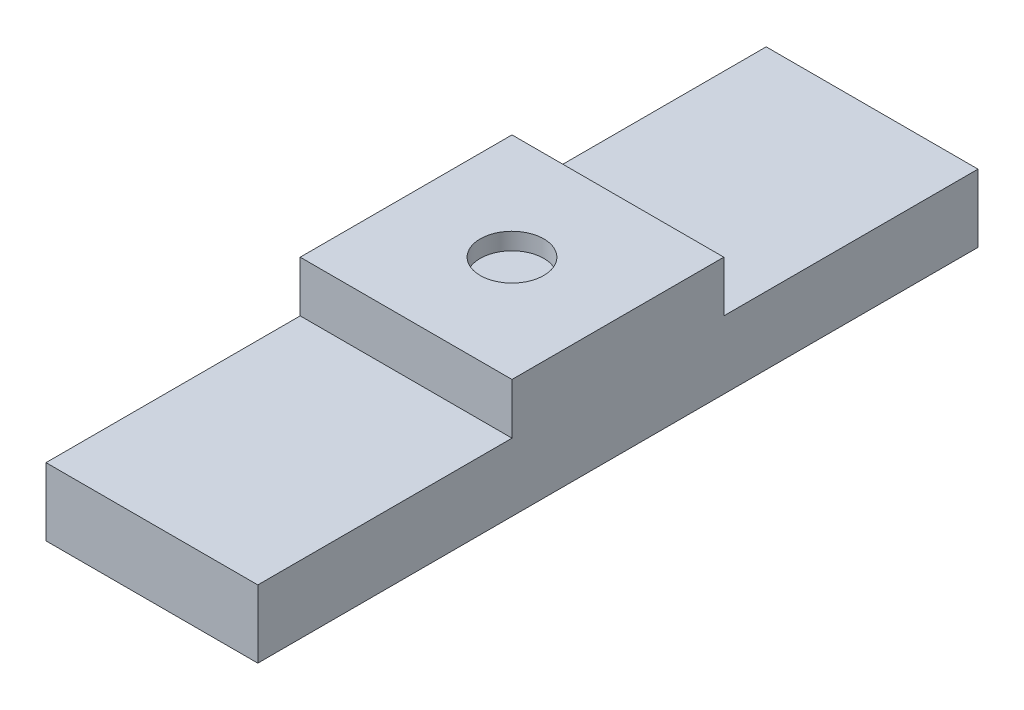
ISO-10303-21;
HEADER;
FILE_DESCRIPTION(('STEP AP214'),'2;1');
FILE_NAME('part.step','',(''),(''),'','','');
FILE_SCHEMA(('AUTOMOTIVE_DESIGN { 1 0 10303 214 1 1 1 1 }'));
ENDSEC;
DATA;
#1=APPLICATION_CONTEXT('core data for automotive mechanical design processes');
#2=APPLICATION_PROTOCOL_DEFINITION('international standard','automotive_design',2000,#1);
#3=PRODUCT_CONTEXT('',#1,'mechanical');
#4=PRODUCT('Part','Part','',(#3));
#5=PRODUCT_RELATED_PRODUCT_CATEGORY('part','',(#4));
#6=PRODUCT_DEFINITION_FORMATION('','',#4);
#7=PRODUCT_DEFINITION_CONTEXT('part definition',#1,'design');
#8=PRODUCT_DEFINITION('design','',#6,#7);
#9=PRODUCT_DEFINITION_SHAPE('','',#8);
#10=(LENGTH_UNIT() NAMED_UNIT(*) SI_UNIT(.MILLI.,.METRE.));
#11=(NAMED_UNIT(*) PLANE_ANGLE_UNIT() SI_UNIT($,.RADIAN.));
#12=(NAMED_UNIT(*) SI_UNIT($,.STERADIAN.) SOLID_ANGLE_UNIT());
#13=UNCERTAINTY_MEASURE_WITH_UNIT(LENGTH_MEASURE(1.E-05),#10,'distance_accuracy_value','');
#14=(GEOMETRIC_REPRESENTATION_CONTEXT(3) GLOBAL_UNCERTAINTY_ASSIGNED_CONTEXT((#13)) GLOBAL_UNIT_ASSIGNED_CONTEXT((#10,
#11,#12)) REPRESENTATION_CONTEXT('',''));
#15=CARTESIAN_POINT('',(0.,0.,0.));
#16=DIRECTION('',(0.,0.,1.));
#17=DIRECTION('',(1.,0.,0.));
#18=AXIS2_PLACEMENT_3D('',#15,#16,#17);
#19=CARTESIAN_POINT('',(0.,0.8,0.));
#20=DIRECTION('',(0.,-1.,0.));
#21=DIRECTION('',(0.,0.,-1.));
#22=AXIS2_PLACEMENT_3D('',#19,#20,#21);
#23=PLANE('',#22);
#24=DIRECTION('',(-1.,0.,0.));
#25=VECTOR('',#24,1.);
#26=CARTESIAN_POINT('',(2.5,0.8,-5.5));
#27=LINE('',#26,#25);
#28=CARTESIAN_POINT('',(2.5,0.8,-5.5));
#29=VERTEX_POINT('',#28);
#30=CARTESIAN_POINT('',(0.,0.8,-5.5));
#31=VERTEX_POINT('',#30);
#32=EDGE_CURVE('E50',#29,#31,#27,.T.);
#33=ORIENTED_EDGE('',*,*,#32,.F.);
#34=DIRECTION('',(0.,0.,-1.));
#35=VECTOR('',#34,1.);
#36=CARTESIAN_POINT('',(2.5,0.8,0.));
#37=LINE('',#36,#35);
#38=CARTESIAN_POINT('',(2.5,0.8,-8.5));
#39=VERTEX_POINT('',#38);
#40=EDGE_CURVE('E171',#29,#39,#37,.T.);
#41=ORIENTED_EDGE('',*,*,#40,.T.);
#42=DIRECTION('',(-1.,0.,0.));
#43=VECTOR('',#42,1.);
#44=CARTESIAN_POINT('',(0.,0.8,-8.5));
#45=LINE('',#44,#43);
#46=CARTESIAN_POINT('',(0.,0.8,-8.5));
#47=VERTEX_POINT('',#46);
#48=EDGE_CURVE('E161',#39,#47,#45,.T.);
#49=ORIENTED_EDGE('',*,*,#48,.T.);
#50=DIRECTION('',(0.,0.,1.));
#51=VECTOR('',#50,1.);
#52=CARTESIAN_POINT('',(0.,0.8,0.));
#53=LINE('',#52,#51);
#54=EDGE_CURVE('E151',#47,#31,#53,.T.);
#55=ORIENTED_EDGE('',*,*,#54,.T.);
#56=EDGE_LOOP('',(#33,#41,#49,#55));
#57=FACE_BOUND('',#56,.T.);
#58=ADVANCED_FACE('F33',(#57),#23,.F.);
#59=DIRECTION('',(1.,0.,0.));
#60=VECTOR('',#59,1.);
#61=CARTESIAN_POINT('',(2.5,0.8,-3.));
#62=LINE('',#61,#60);
#63=CARTESIAN_POINT('',(0.,0.8,-3.));
#64=VERTEX_POINT('',#63);
#65=CARTESIAN_POINT('',(2.5,0.8,-3.));
#66=VERTEX_POINT('',#65);
#67=EDGE_CURVE('E58',#64,#66,#62,.T.);
#68=ORIENTED_EDGE('',*,*,#67,.F.);
#69=CARTESIAN_POINT('',(0.,0.8,0.));
#70=VERTEX_POINT('',#69);
#71=EDGE_CURVE('E122',#64,#70,#53,.T.);
#72=ORIENTED_EDGE('',*,*,#71,.T.);
#73=DIRECTION('',(1.,0.,0.));
#74=VECTOR('',#73,1.);
#75=CARTESIAN_POINT('',(0.,0.8,0.));
#76=LINE('',#75,#74);
#77=CARTESIAN_POINT('',(2.5,0.8,0.));
#78=VERTEX_POINT('',#77);
#79=EDGE_CURVE('E145',#70,#78,#76,.T.);
#80=ORIENTED_EDGE('',*,*,#79,.T.);
#81=EDGE_CURVE('E167',#78,#66,#37,.T.);
#82=ORIENTED_EDGE('',*,*,#81,.T.);
#83=EDGE_LOOP('',(#68,#72,#80,#82));
#84=FACE_BOUND('',#83,.T.);
#85=ADVANCED_FACE('F177',(#84),#23,.F.);
#86=CARTESIAN_POINT('',(0.,0.8,0.));
#87=DIRECTION('',(1.,0.,0.));
#88=DIRECTION('',(0.,0.,-1.));
#89=AXIS2_PLACEMENT_3D('',#86,#87,#88);
#90=PLANE('',#89);
#91=DIRECTION('',(0.,0.,1.));
#92=VECTOR('',#91,1.);
#93=CARTESIAN_POINT('',(0.,0.,0.));
#94=LINE('',#93,#92);
#95=CARTESIAN_POINT('',(0.,0.,-8.5));
#96=VERTEX_POINT('',#95);
#97=CARTESIAN_POINT('',(0.,0.,0.));
#98=VERTEX_POINT('',#97);
#99=EDGE_CURVE('E123',#96,#98,#94,.T.);
#100=ORIENTED_EDGE('',*,*,#99,.T.);
#101=DIRECTION('',(0.,-1.,0.));
#102=VECTOR('',#101,1.);
#103=CARTESIAN_POINT('',(0.,0.8,0.));
#104=LINE('',#103,#102);
#105=EDGE_CURVE('E11',#70,#98,#104,.T.);
#106=ORIENTED_EDGE('',*,*,#105,.F.);
#107=ORIENTED_EDGE('',*,*,#71,.F.);
#108=DIRECTION('',(0.,-1.,0.));
#109=VECTOR('',#108,1.);
#110=CARTESIAN_POINT('',(0.,1.4,-3.));
#111=LINE('',#110,#109);
#112=CARTESIAN_POINT('',(0.,1.4,-3.));
#113=VERTEX_POINT('',#112);
#114=EDGE_CURVE('E104',#113,#64,#111,.T.);
#115=ORIENTED_EDGE('',*,*,#114,.F.);
#116=DIRECTION('',(0.,0.,1.));
#117=VECTOR('',#116,1.);
#118=CARTESIAN_POINT('',(0.,1.4,-3.));
#119=LINE('',#118,#117);
#120=CARTESIAN_POINT('',(0.,1.4,-5.5));
#121=VERTEX_POINT('',#120);
#122=EDGE_CURVE('E110',#121,#113,#119,.T.);
#123=ORIENTED_EDGE('',*,*,#122,.F.);
#124=DIRECTION('',(0.,-1.,0.));
#125=VECTOR('',#124,1.);
#126=CARTESIAN_POINT('',(0.,1.4,-5.5));
#127=LINE('',#126,#125);
#128=EDGE_CURVE('E136',#121,#31,#127,.T.);
#129=ORIENTED_EDGE('',*,*,#128,.T.);
#130=ORIENTED_EDGE('',*,*,#54,.F.);
#131=DIRECTION('',(0.,-1.,0.));
#132=VECTOR('',#131,1.);
#133=CARTESIAN_POINT('',(0.,0.8,-8.5));
#134=LINE('',#133,#132);
#135=EDGE_CURVE('E158',#47,#96,#134,.T.);
#136=ORIENTED_EDGE('',*,*,#135,.T.);
#137=EDGE_LOOP('',(#100,#106,#107,#115,#123,#129,#130,#136));
#138=FACE_BOUND('',#137,.T.);
#139=ADVANCED_FACE('F35',(#138),#90,.F.);
#140=CARTESIAN_POINT('',(0.,0.8,0.));
#141=DIRECTION('',(0.,0.,-1.));
#142=DIRECTION('',(-1.,0.,0.));
#143=AXIS2_PLACEMENT_3D('',#140,#141,#142);
#144=PLANE('',#143);
#145=DIRECTION('',(1.,0.,0.));
#146=VECTOR('',#145,1.);
#147=CARTESIAN_POINT('',(0.,0.,0.));
#148=LINE('',#147,#146);
#149=CARTESIAN_POINT('',(2.5,0.,0.));
#150=VERTEX_POINT('',#149);
#151=EDGE_CURVE('E125',#98,#150,#148,.T.);
#152=ORIENTED_EDGE('',*,*,#151,.T.);
#153=DIRECTION('',(0.,-1.,0.));
#154=VECTOR('',#153,1.);
#155=CARTESIAN_POINT('',(2.5,0.8,0.));
#156=LINE('',#155,#154);
#157=EDGE_CURVE('E42',#78,#150,#156,.T.);
#158=ORIENTED_EDGE('',*,*,#157,.F.);
#159=ORIENTED_EDGE('',*,*,#79,.F.);
#160=ORIENTED_EDGE('',*,*,#105,.T.);
#161=EDGE_LOOP('',(#152,#158,#159,#160));
#162=FACE_BOUND('',#161,.T.);
#163=ADVANCED_FACE('F179',(#162),#144,.F.);
#164=CARTESIAN_POINT('',(2.5,0.8,0.));
#165=DIRECTION('',(-1.,0.,0.));
#166=DIRECTION('',(0.,0.,1.));
#167=AXIS2_PLACEMENT_3D('',#164,#165,#166);
#168=PLANE('',#167);
#169=DIRECTION('',(0.,0.,-1.));
#170=VECTOR('',#169,1.);
#171=CARTESIAN_POINT('',(2.5,0.,0.));
#172=LINE('',#171,#170);
#173=CARTESIAN_POINT('',(2.5,0.,-8.5));
#174=VERTEX_POINT('',#173);
#175=EDGE_CURVE('E164',#150,#174,#172,.T.);
#176=ORIENTED_EDGE('',*,*,#175,.T.);
#177=DIRECTION('',(0.,-1.,0.));
#178=VECTOR('',#177,1.);
#179=CARTESIAN_POINT('',(2.5,0.8,-8.5));
#180=LINE('',#179,#178);
#181=EDGE_CURVE('E155',#39,#174,#180,.T.);
#182=ORIENTED_EDGE('',*,*,#181,.F.);
#183=ORIENTED_EDGE('',*,*,#40,.F.);
#184=DIRECTION('',(0.,-1.,0.));
#185=VECTOR('',#184,1.);
#186=CARTESIAN_POINT('',(2.5,1.4,-5.5));
#187=LINE('',#186,#185);
#188=CARTESIAN_POINT('',(2.5,1.4,-5.5));
#189=VERTEX_POINT('',#188);
#190=EDGE_CURVE('E127',#189,#29,#187,.T.);
#191=ORIENTED_EDGE('',*,*,#190,.F.);
#192=DIRECTION('',(0.,0.,-1.));
#193=VECTOR('',#192,1.);
#194=CARTESIAN_POINT('',(2.5,1.4,-3.));
#195=LINE('',#194,#193);
#196=CARTESIAN_POINT('',(2.5,1.4,-3.));
#197=VERTEX_POINT('',#196);
#198=EDGE_CURVE('E109',#197,#189,#195,.T.);
#199=ORIENTED_EDGE('',*,*,#198,.F.);
#200=DIRECTION('',(0.,-1.,0.));
#201=VECTOR('',#200,1.);
#202=CARTESIAN_POINT('',(2.5,1.4,-3.));
#203=LINE('',#202,#201);
#204=EDGE_CURVE('E106',#197,#66,#203,.T.);
#205=ORIENTED_EDGE('',*,*,#204,.T.);
#206=ORIENTED_EDGE('',*,*,#81,.F.);
#207=ORIENTED_EDGE('',*,*,#157,.T.);
#208=EDGE_LOOP('',(#176,#182,#183,#191,#199,#205,#206,#207));
#209=FACE_BOUND('',#208,.T.);
#210=ADVANCED_FACE('F182',(#209),#168,.F.);
#211=CARTESIAN_POINT('',(0.,0.8,-8.5));
#212=DIRECTION('',(0.,0.,1.));
#213=DIRECTION('',(1.,0.,0.));
#214=AXIS2_PLACEMENT_3D('',#211,#212,#213);
#215=PLANE('',#214);
#216=DIRECTION('',(-1.,0.,0.));
#217=VECTOR('',#216,1.);
#218=CARTESIAN_POINT('',(0.,0.,-8.5));
#219=LINE('',#218,#217);
#220=EDGE_CURVE('E162',#174,#96,#219,.T.);
#221=ORIENTED_EDGE('',*,*,#220,.T.);
#222=ORIENTED_EDGE('',*,*,#135,.F.);
#223=ORIENTED_EDGE('',*,*,#48,.F.);
#224=ORIENTED_EDGE('',*,*,#181,.T.);
#225=EDGE_LOOP('',(#221,#222,#223,#224));
#226=FACE_BOUND('',#225,.T.);
#227=ADVANCED_FACE('F220',(#226),#215,.F.);
#228=CARTESIAN_POINT('',(0.,0.,0.));
#229=DIRECTION('',(0.,-1.,0.));
#230=DIRECTION('',(0.,0.,-1.));
#231=AXIS2_PLACEMENT_3D('',#228,#229,#230);
#232=PLANE('',#231);
#233=ORIENTED_EDGE('',*,*,#99,.F.);
#234=ORIENTED_EDGE('',*,*,#220,.F.);
#235=ORIENTED_EDGE('',*,*,#175,.F.);
#236=ORIENTED_EDGE('',*,*,#151,.F.);
#237=EDGE_LOOP('',(#233,#234,#235,#236));
#238=FACE_BOUND('',#237,.T.);
#239=ADVANCED_FACE('F217',(#238),#232,.T.);
#240=CARTESIAN_POINT('',(2.5,1.4,-3.));
#241=DIRECTION('',(0.,0.,-1.));
#242=DIRECTION('',(-1.,0.,0.));
#243=AXIS2_PLACEMENT_3D('',#240,#241,#242);
#244=PLANE('',#243);
#245=ORIENTED_EDGE('',*,*,#67,.T.);
#246=ORIENTED_EDGE('',*,*,#204,.F.);
#247=DIRECTION('',(1.,0.,0.));
#248=VECTOR('',#247,1.);
#249=CARTESIAN_POINT('',(2.5,1.4,-3.));
#250=LINE('',#249,#248);
#251=EDGE_CURVE('E100',#113,#197,#250,.T.);
#252=ORIENTED_EDGE('',*,*,#251,.F.);
#253=ORIENTED_EDGE('',*,*,#114,.T.);
#254=EDGE_LOOP('',(#245,#246,#252,#253));
#255=FACE_BOUND('',#254,.T.);
#256=ADVANCED_FACE('F102',(#255),#244,.F.);
#257=CARTESIAN_POINT('',(2.5,1.4,-5.5));
#258=DIRECTION('',(0.,0.,1.));
#259=DIRECTION('',(1.,0.,0.));
#260=AXIS2_PLACEMENT_3D('',#257,#258,#259);
#261=PLANE('',#260);
#262=ORIENTED_EDGE('',*,*,#32,.T.);
#263=ORIENTED_EDGE('',*,*,#128,.F.);
#264=DIRECTION('',(-1.,0.,0.));
#265=VECTOR('',#264,1.);
#266=CARTESIAN_POINT('',(2.5,1.4,-5.5));
#267=LINE('',#266,#265);
#268=EDGE_CURVE('E115',#189,#121,#267,.T.);
#269=ORIENTED_EDGE('',*,*,#268,.F.);
#270=ORIENTED_EDGE('',*,*,#190,.T.);
#271=EDGE_LOOP('',(#262,#263,#269,#270));
#272=FACE_BOUND('',#271,.T.);
#273=ADVANCED_FACE('F203',(#272),#261,.F.);
#274=CARTESIAN_POINT('',(0.,1.4,0.));
#275=DIRECTION('',(0.,1.,0.));
#276=DIRECTION('',(0.,0.,1.));
#277=AXIS2_PLACEMENT_3D('',#274,#275,#276);
#278=PLANE('',#277);
#279=CARTESIAN_POINT('',(1.25,1.4,-4.25));
#280=DIRECTION('',(0.,1.,0.));
#281=DIRECTION('',(0.,0.,1.));
#282=AXIS2_PLACEMENT_3D('',#279,#280,#281);
#283=CIRCLE('',#282,0.375);
#284=CARTESIAN_POINT('',(1.25,1.4,-3.875));
#285=VERTEX_POINT('',#284);
#286=EDGE_CURVE('E187',#285,#285,#283,.T.);
#287=ORIENTED_EDGE('',*,*,#286,.F.);
#288=EDGE_LOOP('',(#287));
#289=FACE_BOUND('',#288,.T.);
#290=ORIENTED_EDGE('',*,*,#122,.T.);
#291=ORIENTED_EDGE('',*,*,#251,.T.);
#292=ORIENTED_EDGE('',*,*,#198,.T.);
#293=ORIENTED_EDGE('',*,*,#268,.T.);
#294=EDGE_LOOP('',(#290,#291,#292,#293));
#295=FACE_BOUND('',#294,.T.);
#296=ADVANCED_FACE('F113',(#289,#295),#278,.T.);
#297=CARTESIAN_POINT('',(1.25,1.2,-4.25));
#298=DIRECTION('',(0.,1.,0.));
#299=DIRECTION('',(0.,0.,1.));
#300=AXIS2_PLACEMENT_3D('',#297,#298,#299);
#301=CYLINDRICAL_SURFACE('',#300,0.375);
#302=CARTESIAN_POINT('',(1.25,1.2,-4.25));
#303=DIRECTION('',(0.,1.,0.));
#304=DIRECTION('',(0.,0.,1.));
#305=AXIS2_PLACEMENT_3D('',#302,#303,#304);
#306=CIRCLE('',#305,0.375);
#307=CARTESIAN_POINT('',(1.25,1.2,-3.875));
#308=VERTEX_POINT('',#307);
#309=EDGE_CURVE('E190',#308,#308,#306,.T.);
#310=ORIENTED_EDGE('',*,*,#309,.F.);
#311=EDGE_LOOP('',(#310));
#312=FACE_BOUND('',#311,.T.);
#313=ORIENTED_EDGE('',*,*,#286,.T.);
#314=EDGE_LOOP('',(#313));
#315=FACE_BOUND('',#314,.T.);
#316=ADVANCED_FACE('F196',(#312,#315),#301,.F.);
#317=CARTESIAN_POINT('',(1.25,1.2,-4.25));
#318=DIRECTION('',(0.,1.,0.));
#319=DIRECTION('',(0.,0.,1.));
#320=AXIS2_PLACEMENT_3D('',#317,#318,#319);
#321=PLANE('',#320);
#322=ORIENTED_EDGE('',*,*,#309,.T.);
#323=EDGE_LOOP('',(#322));
#324=FACE_BOUND('',#323,.T.);
#325=ADVANCED_FACE('F194',(#324),#321,.T.);
#326=CLOSED_SHELL('',(#58,#85,#139,#163,#210,#227,#239,#256,#273,#296,#316,#325));
#327=MANIFOLD_SOLID_BREP('B2',#326);
#328=ADVANCED_BREP_SHAPE_REPRESENTATION('',(#18,#327),#14);
#329=SHAPE_DEFINITION_REPRESENTATION(#9,#328);
ENDSEC;
END-ISO-10303-21;
